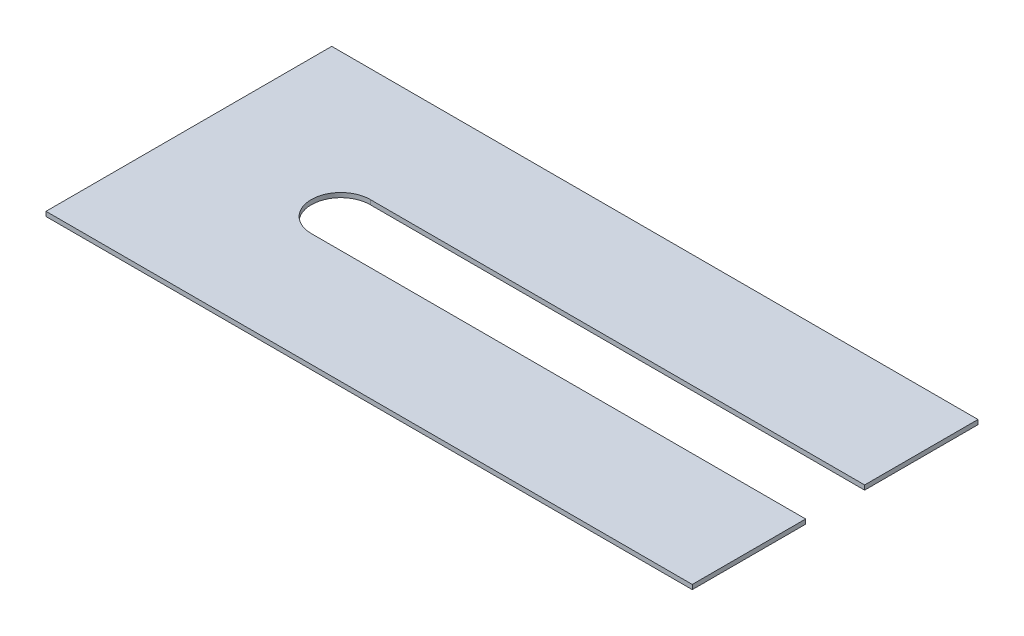
ISO-10303-21;
HEADER;
FILE_DESCRIPTION(('STEP AP214'),'2;1');
FILE_NAME('part.step','',(''),(''),'','','');
FILE_SCHEMA(('AUTOMOTIVE_DESIGN { 1 0 10303 214 1 1 1 1 }'));
ENDSEC;
DATA;
#1=APPLICATION_CONTEXT('core data for automotive mechanical design processes');
#2=APPLICATION_PROTOCOL_DEFINITION('international standard','automotive_design',2000,#1);
#3=PRODUCT_CONTEXT('',#1,'mechanical');
#4=PRODUCT('Part','Part','',(#3));
#5=PRODUCT_RELATED_PRODUCT_CATEGORY('part','',(#4));
#6=PRODUCT_DEFINITION_FORMATION('','',#4);
#7=PRODUCT_DEFINITION_CONTEXT('part definition',#1,'design');
#8=PRODUCT_DEFINITION('design','',#6,#7);
#9=PRODUCT_DEFINITION_SHAPE('','',#8);
#10=(LENGTH_UNIT() NAMED_UNIT(*) SI_UNIT(.MILLI.,.METRE.));
#11=(NAMED_UNIT(*) PLANE_ANGLE_UNIT() SI_UNIT($,.RADIAN.));
#12=(NAMED_UNIT(*) SI_UNIT($,.STERADIAN.) SOLID_ANGLE_UNIT());
#13=UNCERTAINTY_MEASURE_WITH_UNIT(LENGTH_MEASURE(1.E-05),#10,'distance_accuracy_value','');
#14=(GEOMETRIC_REPRESENTATION_CONTEXT(3) GLOBAL_UNCERTAINTY_ASSIGNED_CONTEXT((#13)) GLOBAL_UNIT_ASSIGNED_CONTEXT((#10,
#11,#12)) REPRESENTATION_CONTEXT('',''));
#15=CARTESIAN_POINT('',(0.,0.,0.));
#16=DIRECTION('',(0.,0.,1.));
#17=DIRECTION('',(1.,0.,0.));
#18=AXIS2_PLACEMENT_3D('',#15,#16,#17);
#19=CARTESIAN_POINT('',(16.75,0.5,-15.75));
#20=DIRECTION('',(0.,-1.,0.));
#21=DIRECTION('',(0.,0.,-1.));
#22=AXIS2_PLACEMENT_3D('',#19,#20,#21);
#23=CYLINDRICAL_SURFACE('',#22,3.25);
#24=CARTESIAN_POINT('',(16.75,0.,-15.75));
#25=DIRECTION('',(0.,1.,0.));
#26=DIRECTION('',(0.,0.,1.));
#27=AXIS2_PLACEMENT_3D('',#24,#25,#26);
#28=CIRCLE('',#27,3.25);
#29=CARTESIAN_POINT('',(16.75,0.,-19.));
#30=VERTEX_POINT('',#29);
#31=CARTESIAN_POINT('',(16.75,0.,-12.5));
#32=VERTEX_POINT('',#31);
#33=EDGE_CURVE('E191',#30,#32,#28,.T.);
#34=ORIENTED_EDGE('',*,*,#33,.F.);
#35=DIRECTION('',(0.,-1.,0.));
#36=VECTOR('',#35,1.);
#37=CARTESIAN_POINT('',(16.75,0.5,-19.));
#38=LINE('',#37,#36);
#39=CARTESIAN_POINT('',(16.75,0.5,-19.));
#40=VERTEX_POINT('',#39);
#41=EDGE_CURVE('E11',#40,#30,#38,.T.);
#42=ORIENTED_EDGE('',*,*,#41,.F.);
#43=CARTESIAN_POINT('',(16.75,0.5,-15.75));
#44=DIRECTION('',(0.,1.,0.));
#45=DIRECTION('',(0.,0.,1.));
#46=AXIS2_PLACEMENT_3D('',#43,#44,#45);
#47=CIRCLE('',#46,3.25);
#48=CARTESIAN_POINT('',(16.75,0.5,-12.5));
#49=VERTEX_POINT('',#48);
#50=EDGE_CURVE('E147',#40,#49,#47,.T.);
#51=ORIENTED_EDGE('',*,*,#50,.T.);
#52=DIRECTION('',(0.,-1.,0.));
#53=VECTOR('',#52,1.);
#54=CARTESIAN_POINT('',(16.75,0.5,-12.5));
#55=LINE('',#54,#53);
#56=EDGE_CURVE('E91',#49,#32,#55,.T.);
#57=ORIENTED_EDGE('',*,*,#56,.T.);
#58=EDGE_LOOP('',(#34,#42,#51,#57));
#59=FACE_BOUND('',#58,.T.);
#60=ADVANCED_FACE('F39',(#59),#23,.F.);
#61=CARTESIAN_POINT('',(0.,0.5,-19.));
#62=DIRECTION('',(0.,0.,1.));
#63=DIRECTION('',(1.,0.,0.));
#64=AXIS2_PLACEMENT_3D('',#61,#62,#63);
#65=PLANE('',#64);
#66=DIRECTION('',(-1.,0.,0.));
#67=VECTOR('',#66,1.);
#68=CARTESIAN_POINT('',(0.,0.,-19.));
#69=LINE('',#68,#67);
#70=CARTESIAN_POINT('',(71.25,0.,-19.));
#71=VERTEX_POINT('',#70);
#72=EDGE_CURVE('E184',#71,#30,#69,.T.);
#73=ORIENTED_EDGE('',*,*,#72,.F.);
#74=DIRECTION('',(0.,-1.,0.));
#75=VECTOR('',#74,1.);
#76=CARTESIAN_POINT('',(71.25,0.5,-19.));
#77=LINE('',#76,#75);
#78=CARTESIAN_POINT('',(71.25,0.5,-19.));
#79=VERTEX_POINT('',#78);
#80=EDGE_CURVE('E48',#79,#71,#77,.T.);
#81=ORIENTED_EDGE('',*,*,#80,.F.);
#82=DIRECTION('',(-1.,0.,0.));
#83=VECTOR('',#82,1.);
#84=CARTESIAN_POINT('',(0.,0.5,-19.));
#85=LINE('',#84,#83);
#86=EDGE_CURVE('E139',#79,#40,#85,.T.);
#87=ORIENTED_EDGE('',*,*,#86,.T.);
#88=ORIENTED_EDGE('',*,*,#41,.T.);
#89=EDGE_LOOP('',(#73,#81,#87,#88));
#90=FACE_BOUND('',#89,.T.);
#91=ADVANCED_FACE('F189',(#90),#65,.T.);
#92=CARTESIAN_POINT('',(71.25,0.5,0.));
#93=DIRECTION('',(-1.,0.,0.));
#94=DIRECTION('',(0.,0.,1.));
#95=AXIS2_PLACEMENT_3D('',#92,#93,#94);
#96=PLANE('',#95);
#97=DIRECTION('',(0.,0.,-1.));
#98=VECTOR('',#97,1.);
#99=CARTESIAN_POINT('',(71.25,0.,0.));
#100=LINE('',#99,#98);
#101=CARTESIAN_POINT('',(71.25,0.,-31.5));
#102=VERTEX_POINT('',#101);
#103=EDGE_CURVE('E159',#71,#102,#100,.T.);
#104=ORIENTED_EDGE('',*,*,#103,.T.);
#105=DIRECTION('',(0.,-1.,0.));
#106=VECTOR('',#105,1.);
#107=CARTESIAN_POINT('',(71.25,0.5,-31.5));
#108=LINE('',#107,#106);
#109=CARTESIAN_POINT('',(71.25,0.5,-31.5));
#110=VERTEX_POINT('',#109);
#111=EDGE_CURVE('E172',#110,#102,#108,.T.);
#112=ORIENTED_EDGE('',*,*,#111,.F.);
#113=DIRECTION('',(0.,0.,-1.));
#114=VECTOR('',#113,1.);
#115=CARTESIAN_POINT('',(71.25,0.5,0.));
#116=LINE('',#115,#114);
#117=EDGE_CURVE('E132',#79,#110,#116,.T.);
#118=ORIENTED_EDGE('',*,*,#117,.F.);
#119=ORIENTED_EDGE('',*,*,#80,.T.);
#120=EDGE_LOOP('',(#104,#112,#118,#119));
#121=FACE_BOUND('',#120,.T.);
#122=ADVANCED_FACE('F178',(#121),#96,.F.);
#123=CARTESIAN_POINT('',(0.,0.5,-31.5));
#124=DIRECTION('',(0.,0.,-1.));
#125=DIRECTION('',(-1.,0.,0.));
#126=AXIS2_PLACEMENT_3D('',#123,#124,#125);
#127=PLANE('',#126);
#128=DIRECTION('',(1.,0.,0.));
#129=VECTOR('',#128,1.);
#130=CARTESIAN_POINT('',(0.,0.,-31.5));
#131=LINE('',#130,#129);
#132=CARTESIAN_POINT('',(0.,0.,-31.5));
#133=VERTEX_POINT('',#132);
#134=EDGE_CURVE('E187',#133,#102,#131,.T.);
#135=ORIENTED_EDGE('',*,*,#134,.F.);
#136=DIRECTION('',(0.,-1.,0.));
#137=VECTOR('',#136,1.);
#138=CARTESIAN_POINT('',(0.,0.5,-31.5));
#139=LINE('',#138,#137);
#140=CARTESIAN_POINT('',(0.,0.5,-31.5));
#141=VERTEX_POINT('',#140);
#142=EDGE_CURVE('E169',#141,#133,#139,.T.);
#143=ORIENTED_EDGE('',*,*,#142,.F.);
#144=DIRECTION('',(1.,0.,0.));
#145=VECTOR('',#144,1.);
#146=CARTESIAN_POINT('',(0.,0.5,-31.5));
#147=LINE('',#146,#145);
#148=EDGE_CURVE('E138',#141,#110,#147,.T.);
#149=ORIENTED_EDGE('',*,*,#148,.T.);
#150=ORIENTED_EDGE('',*,*,#111,.T.);
#151=EDGE_LOOP('',(#135,#143,#149,#150));
#152=FACE_BOUND('',#151,.T.);
#153=ADVANCED_FACE('F204',(#152),#127,.T.);
#154=CARTESIAN_POINT('',(0.,0.5,0.));
#155=DIRECTION('',(-1.,0.,0.));
#156=DIRECTION('',(0.,0.,1.));
#157=AXIS2_PLACEMENT_3D('',#154,#155,#156);
#158=PLANE('',#157);
#159=DIRECTION('',(0.,0.,-1.));
#160=VECTOR('',#159,1.);
#161=CARTESIAN_POINT('',(0.,0.,0.));
#162=LINE('',#161,#160);
#163=CARTESIAN_POINT('',(0.,0.,0.));
#164=VERTEX_POINT('',#163);
#165=EDGE_CURVE('E197',#164,#133,#162,.T.);
#166=ORIENTED_EDGE('',*,*,#165,.F.);
#167=DIRECTION('',(0.,-1.,0.));
#168=VECTOR('',#167,1.);
#169=CARTESIAN_POINT('',(0.,0.5,0.));
#170=LINE('',#169,#168);
#171=CARTESIAN_POINT('',(0.,0.5,0.));
#172=VERTEX_POINT('',#171);
#173=EDGE_CURVE('E126',#172,#164,#170,.T.);
#174=ORIENTED_EDGE('',*,*,#173,.F.);
#175=DIRECTION('',(0.,0.,-1.));
#176=VECTOR('',#175,1.);
#177=CARTESIAN_POINT('',(0.,0.5,0.));
#178=LINE('',#177,#176);
#179=EDGE_CURVE('E117',#172,#141,#178,.T.);
#180=ORIENTED_EDGE('',*,*,#179,.T.);
#181=ORIENTED_EDGE('',*,*,#142,.T.);
#182=EDGE_LOOP('',(#166,#174,#180,#181));
#183=FACE_BOUND('',#182,.T.);
#184=ADVANCED_FACE('F202',(#183),#158,.T.);
#185=CARTESIAN_POINT('',(0.,0.5,0.));
#186=DIRECTION('',(0.,0.,-1.));
#187=DIRECTION('',(-1.,0.,0.));
#188=AXIS2_PLACEMENT_3D('',#185,#186,#187);
#189=PLANE('',#188);
#190=DIRECTION('',(1.,0.,0.));
#191=VECTOR('',#190,1.);
#192=CARTESIAN_POINT('',(0.,0.,0.));
#193=LINE('',#192,#191);
#194=CARTESIAN_POINT('',(71.25,0.,0.));
#195=VERTEX_POINT('',#194);
#196=EDGE_CURVE('E124',#164,#195,#193,.T.);
#197=ORIENTED_EDGE('',*,*,#196,.T.);
#198=DIRECTION('',(0.,-1.,0.));
#199=VECTOR('',#198,1.);
#200=CARTESIAN_POINT('',(71.25,0.5,0.));
#201=LINE('',#200,#199);
#202=CARTESIAN_POINT('',(71.25,0.5,0.));
#203=VERTEX_POINT('',#202);
#204=EDGE_CURVE('E121',#203,#195,#201,.T.);
#205=ORIENTED_EDGE('',*,*,#204,.F.);
#206=DIRECTION('',(1.,0.,0.));
#207=VECTOR('',#206,1.);
#208=CARTESIAN_POINT('',(0.,0.5,0.));
#209=LINE('',#208,#207);
#210=EDGE_CURVE('E110',#172,#203,#209,.T.);
#211=ORIENTED_EDGE('',*,*,#210,.F.);
#212=ORIENTED_EDGE('',*,*,#173,.T.);
#213=EDGE_LOOP('',(#197,#205,#211,#212));
#214=FACE_BOUND('',#213,.T.);
#215=ADVANCED_FACE('F122',(#214),#189,.F.);
#216=CARTESIAN_POINT('',(71.25,0.,-12.5));
#217=VERTEX_POINT('',#216);
#218=EDGE_CURVE('E84',#195,#217,#100,.T.);
#219=ORIENTED_EDGE('',*,*,#218,.T.);
#220=DIRECTION('',(0.,-1.,0.));
#221=VECTOR('',#220,1.);
#222=CARTESIAN_POINT('',(71.25,0.5,-12.5));
#223=LINE('',#222,#221);
#224=CARTESIAN_POINT('',(71.25,0.5,-12.5));
#225=VERTEX_POINT('',#224);
#226=EDGE_CURVE('E127',#225,#217,#223,.T.);
#227=ORIENTED_EDGE('',*,*,#226,.F.);
#228=EDGE_CURVE('E114',#203,#225,#116,.T.);
#229=ORIENTED_EDGE('',*,*,#228,.F.);
#230=ORIENTED_EDGE('',*,*,#204,.T.);
#231=EDGE_LOOP('',(#219,#227,#229,#230));
#232=FACE_BOUND('',#231,.T.);
#233=ADVANCED_FACE('F129',(#232),#96,.F.);
#234=CARTESIAN_POINT('',(0.,0.5,-12.5));
#235=DIRECTION('',(0.,0.,1.));
#236=DIRECTION('',(1.,0.,0.));
#237=AXIS2_PLACEMENT_3D('',#234,#235,#236);
#238=PLANE('',#237);
#239=DIRECTION('',(-1.,0.,0.));
#240=VECTOR('',#239,1.);
#241=CARTESIAN_POINT('',(0.,0.,-12.5));
#242=LINE('',#241,#240);
#243=EDGE_CURVE('E150',#217,#32,#242,.T.);
#244=ORIENTED_EDGE('',*,*,#243,.T.);
#245=ORIENTED_EDGE('',*,*,#56,.F.);
#246=DIRECTION('',(-1.,0.,0.));
#247=VECTOR('',#246,1.);
#248=CARTESIAN_POINT('',(0.,0.5,-12.5));
#249=LINE('',#248,#247);
#250=EDGE_CURVE('E56',#225,#49,#249,.T.);
#251=ORIENTED_EDGE('',*,*,#250,.F.);
#252=ORIENTED_EDGE('',*,*,#226,.T.);
#253=EDGE_LOOP('',(#244,#245,#251,#252));
#254=FACE_BOUND('',#253,.T.);
#255=ADVANCED_FACE('F250',(#254),#238,.F.);
#256=CARTESIAN_POINT('',(0.,0.5,0.));
#257=DIRECTION('',(0.,1.,0.));
#258=DIRECTION('',(0.,0.,1.));
#259=AXIS2_PLACEMENT_3D('',#256,#257,#258);
#260=PLANE('',#259);
#261=ORIENTED_EDGE('',*,*,#50,.F.);
#262=ORIENTED_EDGE('',*,*,#86,.F.);
#263=ORIENTED_EDGE('',*,*,#117,.T.);
#264=ORIENTED_EDGE('',*,*,#148,.F.);
#265=ORIENTED_EDGE('',*,*,#179,.F.);
#266=ORIENTED_EDGE('',*,*,#210,.T.);
#267=ORIENTED_EDGE('',*,*,#228,.T.);
#268=ORIENTED_EDGE('',*,*,#250,.T.);
#269=EDGE_LOOP('',(#261,#262,#263,#264,#265,#266,#267,#268));
#270=FACE_BOUND('',#269,.T.);
#271=ADVANCED_FACE('F112',(#270),#260,.T.);
#272=CARTESIAN_POINT('',(0.,0.,0.));
#273=DIRECTION('',(0.,1.,0.));
#274=DIRECTION('',(0.,0.,1.));
#275=AXIS2_PLACEMENT_3D('',#272,#273,#274);
#276=PLANE('',#275);
#277=ORIENTED_EDGE('',*,*,#33,.T.);
#278=ORIENTED_EDGE('',*,*,#243,.F.);
#279=ORIENTED_EDGE('',*,*,#218,.F.);
#280=ORIENTED_EDGE('',*,*,#196,.F.);
#281=ORIENTED_EDGE('',*,*,#165,.T.);
#282=ORIENTED_EDGE('',*,*,#134,.T.);
#283=ORIENTED_EDGE('',*,*,#103,.F.);
#284=ORIENTED_EDGE('',*,*,#72,.T.);
#285=EDGE_LOOP('',(#277,#278,#279,#280,#281,#282,#283,#284));
#286=FACE_BOUND('',#285,.T.);
#287=ADVANCED_FACE('F183',(#286),#276,.F.);
#288=CLOSED_SHELL('',(#60,#91,#122,#153,#184,#215,#233,#255,#271,#287));
#289=MANIFOLD_SOLID_BREP('B2',#288);
#290=ADVANCED_BREP_SHAPE_REPRESENTATION('',(#18,#289),#14);
#291=SHAPE_DEFINITION_REPRESENTATION(#9,#290);
ENDSEC;
END-ISO-10303-21;
